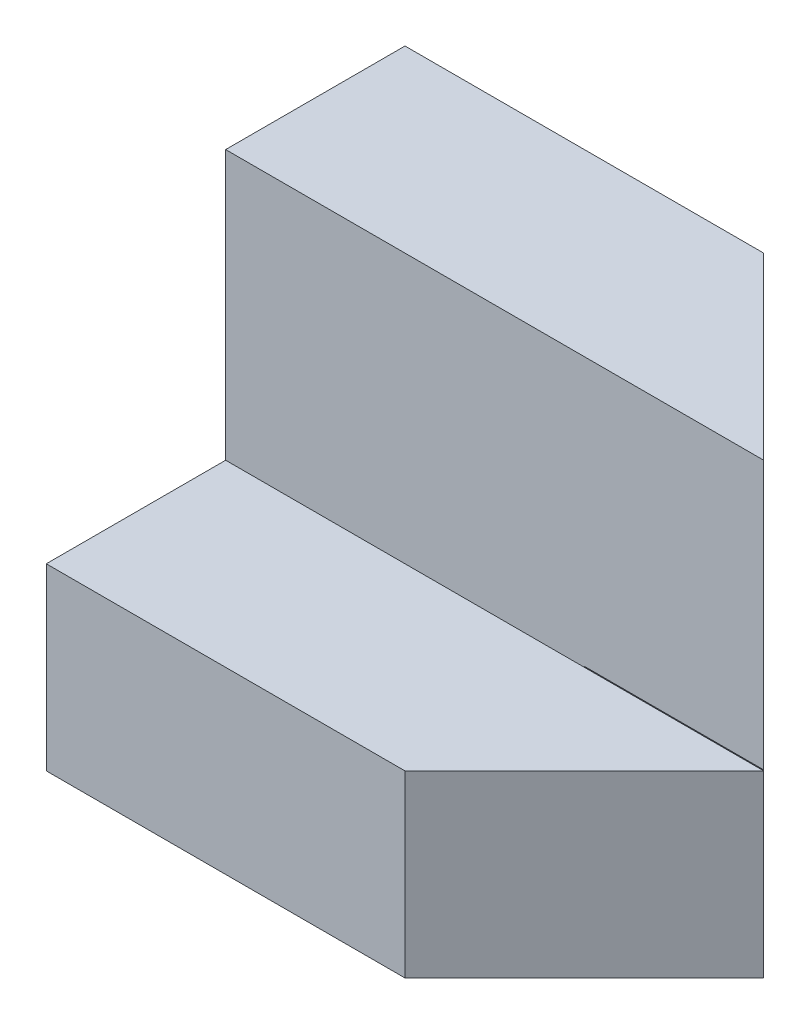
ISO-10303-21;
HEADER;
FILE_DESCRIPTION(('STEP AP214'),'2;1');
FILE_NAME('part.step','',(''),(''),'','','');
FILE_SCHEMA(('AUTOMOTIVE_DESIGN { 1 0 10303 214 1 1 1 1 }'));
ENDSEC;
DATA;
#1=APPLICATION_CONTEXT('core data for automotive mechanical design processes');
#2=APPLICATION_PROTOCOL_DEFINITION('international standard','automotive_design',2000,#1);
#3=PRODUCT_CONTEXT('',#1,'mechanical');
#4=PRODUCT('Part','Part','',(#3));
#5=PRODUCT_RELATED_PRODUCT_CATEGORY('part','',(#4));
#6=PRODUCT_DEFINITION_FORMATION('','',#4);
#7=PRODUCT_DEFINITION_CONTEXT('part definition',#1,'design');
#8=PRODUCT_DEFINITION('design','',#6,#7);
#9=PRODUCT_DEFINITION_SHAPE('','',#8);
#10=(LENGTH_UNIT() NAMED_UNIT(*) SI_UNIT(.MILLI.,.METRE.));
#11=(NAMED_UNIT(*) PLANE_ANGLE_UNIT() SI_UNIT($,.RADIAN.));
#12=(NAMED_UNIT(*) SI_UNIT($,.STERADIAN.) SOLID_ANGLE_UNIT());
#13=UNCERTAINTY_MEASURE_WITH_UNIT(LENGTH_MEASURE(1.E-05),#10,'distance_accuracy_value','');
#14=(GEOMETRIC_REPRESENTATION_CONTEXT(3) GLOBAL_UNCERTAINTY_ASSIGNED_CONTEXT((#13)) GLOBAL_UNIT_ASSIGNED_CONTEXT((#10,
#11,#12)) REPRESENTATION_CONTEXT('',''));
#15=CARTESIAN_POINT('',(0.,0.,0.));
#16=DIRECTION('',(0.,0.,1.));
#17=DIRECTION('',(1.,0.,0.));
#18=AXIS2_PLACEMENT_3D('',#15,#16,#17);
#19=CARTESIAN_POINT('',(2.,-2.5,2.));
#20=DIRECTION('',(-1.,0.,0.));
#21=DIRECTION('',(0.,0.,1.));
#22=AXIS2_PLACEMENT_3D('',#19,#20,#21);
#23=PLANE('',#22);
#24=DIRECTION('',(0.,0.,1.));
#25=VECTOR('',#24,1.);
#26=CARTESIAN_POINT('',(2.,-0.49,2.));
#27=LINE('',#26,#25);
#28=CARTESIAN_POINT('',(2.,-0.49,0.));
#29=VERTEX_POINT('',#28);
#30=CARTESIAN_POINT('',(2.,-0.49,2.));
#31=VERTEX_POINT('',#30);
#32=EDGE_CURVE('E49',#29,#31,#27,.T.);
#33=ORIENTED_EDGE('',*,*,#32,.T.);
#34=DIRECTION('',(0.,1.,0.));
#35=VECTOR('',#34,1.);
#36=CARTESIAN_POINT('',(2.,-2.5,2.));
#37=LINE('',#36,#35);
#38=CARTESIAN_POINT('',(2.,-0.5,2.));
#39=VERTEX_POINT('',#38);
#40=EDGE_CURVE('E120',#39,#31,#37,.T.);
#41=ORIENTED_EDGE('',*,*,#40,.F.);
#42=DIRECTION('',(0.,1.,0.));
#43=VECTOR('',#42,1.);
#44=CARTESIAN_POINT('',(2.,-2.5,2.));
#45=LINE('',#44,#43);
#46=CARTESIAN_POINT('',(2.,-2.5,2.));
#47=VERTEX_POINT('',#46);
#48=EDGE_CURVE('E142',#47,#39,#45,.T.);
#49=ORIENTED_EDGE('',*,*,#48,.F.);
#50=DIRECTION('',(0.,0.,-1.));
#51=VECTOR('',#50,1.);
#52=CARTESIAN_POINT('',(2.,-2.5,2.));
#53=LINE('',#52,#51);
#54=CARTESIAN_POINT('',(2.,-2.5,0.));
#55=VERTEX_POINT('',#54);
#56=EDGE_CURVE('E147',#47,#55,#53,.T.);
#57=ORIENTED_EDGE('',*,*,#56,.T.);
#58=DIRECTION('',(0.,1.,0.));
#59=VECTOR('',#58,1.);
#60=CARTESIAN_POINT('',(2.,-2.5,0.));
#61=LINE('',#60,#59);
#62=EDGE_CURVE('E190',#55,#29,#61,.T.);
#63=ORIENTED_EDGE('',*,*,#62,.T.);
#64=EDGE_LOOP('',(#33,#41,#49,#57,#63));
#65=FACE_BOUND('',#64,.T.);
#66=ADVANCED_FACE('F33',(#65),#23,.F.);
#67=CARTESIAN_POINT('',(0.,0.,2.));
#68=DIRECTION('',(0.,0.,-1.));
#69=DIRECTION('',(-1.,0.,0.));
#70=AXIS2_PLACEMENT_3D('',#67,#68,#69);
#71=PLANE('',#70);
#72=DIRECTION('',(-1.,0.,0.));
#73=VECTOR('',#72,1.);
#74=CARTESIAN_POINT('',(-2.,-0.5,2.));
#75=LINE('',#74,#73);
#76=CARTESIAN_POINT('',(-2.,-0.5,2.));
#77=VERTEX_POINT('',#76);
#78=EDGE_CURVE('E146',#39,#77,#75,.T.);
#79=ORIENTED_EDGE('',*,*,#78,.F.);
#80=ORIENTED_EDGE('',*,*,#40,.T.);
#81=DIRECTION('',(1.,0.,0.));
#82=VECTOR('',#81,1.);
#83=CARTESIAN_POINT('',(4.00000000000005,-0.49,2.));
#84=LINE('',#83,#82);
#85=CARTESIAN_POINT('',(4.00000000000005,-0.49,2.));
#86=VERTEX_POINT('',#85);
#87=EDGE_CURVE('E117',#31,#86,#84,.T.);
#88=ORIENTED_EDGE('',*,*,#87,.T.);
#89=DIRECTION('',(0.,1.,0.));
#90=VECTOR('',#89,1.);
#91=CARTESIAN_POINT('',(4.00000000000005,-0.49,2.));
#92=LINE('',#91,#90);
#93=CARTESIAN_POINT('',(4.00000000000005,2.5,2.));
#94=VERTEX_POINT('',#93);
#95=EDGE_CURVE('E107',#86,#94,#92,.T.);
#96=ORIENTED_EDGE('',*,*,#95,.T.);
#97=DIRECTION('',(-1.,0.,0.));
#98=VECTOR('',#97,1.);
#99=CARTESIAN_POINT('',(-2.,2.5,2.));
#100=LINE('',#99,#98);
#101=CARTESIAN_POINT('',(-2.,2.5,2.));
#102=VERTEX_POINT('',#101);
#103=EDGE_CURVE('E178',#94,#102,#100,.T.);
#104=ORIENTED_EDGE('',*,*,#103,.T.);
#105=DIRECTION('',(0.,-1.,0.));
#106=VECTOR('',#105,1.);
#107=CARTESIAN_POINT('',(-2.,-2.5,2.));
#108=LINE('',#107,#106);
#109=EDGE_CURVE('E176',#102,#77,#108,.T.);
#110=ORIENTED_EDGE('',*,*,#109,.T.);
#111=EDGE_LOOP('',(#79,#80,#88,#96,#104,#110));
#112=FACE_BOUND('',#111,.T.);
#113=ADVANCED_FACE('F119',(#112),#71,.F.);
#114=CARTESIAN_POINT('',(-2.,2.5,2.));
#115=DIRECTION('',(0.,-1.,0.));
#116=DIRECTION('',(0.,0.,-1.));
#117=AXIS2_PLACEMENT_3D('',#114,#115,#116);
#118=PLANE('',#117);
#119=DIRECTION('',(-1.,0.,0.));
#120=VECTOR('',#119,1.);
#121=CARTESIAN_POINT('',(-2.,2.5,0.));
#122=LINE('',#121,#120);
#123=CARTESIAN_POINT('',(2.,2.5,0.));
#124=VERTEX_POINT('',#123);
#125=CARTESIAN_POINT('',(-2.,2.5,0.));
#126=VERTEX_POINT('',#125);
#127=EDGE_CURVE('E192',#124,#126,#122,.T.);
#128=ORIENTED_EDGE('',*,*,#127,.T.);
#129=DIRECTION('',(0.,0.,-1.));
#130=VECTOR('',#129,1.);
#131=CARTESIAN_POINT('',(-2.,2.5,2.));
#132=LINE('',#131,#130);
#133=EDGE_CURVE('E11',#102,#126,#132,.T.);
#134=ORIENTED_EDGE('',*,*,#133,.F.);
#135=ORIENTED_EDGE('',*,*,#103,.F.);
#136=DIRECTION('',(-0.707106781186556,0.,-0.707106781186539));
#137=VECTOR('',#136,1.);
#138=CARTESIAN_POINT('',(2.,2.5,0.));
#139=LINE('',#138,#137);
#140=EDGE_CURVE('E113',#94,#124,#139,.T.);
#141=ORIENTED_EDGE('',*,*,#140,.T.);
#142=EDGE_LOOP('',(#128,#134,#135,#141));
#143=FACE_BOUND('',#142,.T.);
#144=ADVANCED_FACE('F225',(#143),#118,.F.);
#145=CARTESIAN_POINT('',(-2.,-2.5,2.));
#146=DIRECTION('',(1.,0.,0.));
#147=DIRECTION('',(0.,0.,-1.));
#148=AXIS2_PLACEMENT_3D('',#145,#146,#147);
#149=PLANE('',#148);
#150=DIRECTION('',(0.,-1.,0.));
#151=VECTOR('',#150,1.);
#152=CARTESIAN_POINT('',(-2.,-2.5,0.));
#153=LINE('',#152,#151);
#154=CARTESIAN_POINT('',(-2.,-2.5,0.));
#155=VERTEX_POINT('',#154);
#156=EDGE_CURVE('E195',#126,#155,#153,.T.);
#157=ORIENTED_EDGE('',*,*,#156,.T.);
#158=DIRECTION('',(0.,0.,-1.));
#159=VECTOR('',#158,1.);
#160=CARTESIAN_POINT('',(-2.,-2.5,2.));
#161=LINE('',#160,#159);
#162=CARTESIAN_POINT('',(-2.,-2.5,4.));
#163=VERTEX_POINT('',#162);
#164=EDGE_CURVE('E41',#163,#155,#161,.T.);
#165=ORIENTED_EDGE('',*,*,#164,.F.);
#166=DIRECTION('',(0.,-1.,0.));
#167=VECTOR('',#166,1.);
#168=CARTESIAN_POINT('',(-2.,-2.5,4.));
#169=LINE('',#168,#167);
#170=CARTESIAN_POINT('',(-2.,-0.5,4.));
#171=VERTEX_POINT('',#170);
#172=EDGE_CURVE('E326',#171,#163,#169,.T.);
#173=ORIENTED_EDGE('',*,*,#172,.F.);
#174=DIRECTION('',(0.,0.,-1.));
#175=VECTOR('',#174,1.);
#176=CARTESIAN_POINT('',(-2.,-0.5,4.));
#177=LINE('',#176,#175);
#178=EDGE_CURVE('E193',#171,#77,#177,.T.);
#179=ORIENTED_EDGE('',*,*,#178,.T.);
#180=ORIENTED_EDGE('',*,*,#109,.F.);
#181=ORIENTED_EDGE('',*,*,#133,.T.);
#182=EDGE_LOOP('',(#157,#165,#173,#179,#180,#181));
#183=FACE_BOUND('',#182,.T.);
#184=ADVANCED_FACE('F200',(#183),#149,.F.);
#185=CARTESIAN_POINT('',(-2.,-2.5,2.));
#186=DIRECTION('',(0.,1.,0.));
#187=DIRECTION('',(0.,0.,1.));
#188=AXIS2_PLACEMENT_3D('',#185,#186,#187);
#189=PLANE('',#188);
#190=DIRECTION('',(1.,0.,0.));
#191=VECTOR('',#190,1.);
#192=CARTESIAN_POINT('',(-2.,-2.5,0.));
#193=LINE('',#192,#191);
#194=EDGE_CURVE('E175',#155,#55,#193,.T.);
#195=ORIENTED_EDGE('',*,*,#194,.T.);
#196=ORIENTED_EDGE('',*,*,#56,.F.);
#197=DIRECTION('',(-1.,0.,0.));
#198=VECTOR('',#197,1.);
#199=CARTESIAN_POINT('',(4.,-2.5,2.));
#200=LINE('',#199,#198);
#201=CARTESIAN_POINT('',(4.,-2.5,2.));
#202=VERTEX_POINT('',#201);
#203=EDGE_CURVE('E133',#202,#47,#200,.T.);
#204=ORIENTED_EDGE('',*,*,#203,.F.);
#205=DIRECTION('',(0.707106781186547,0.,-0.707106781186548));
#206=VECTOR('',#205,1.);
#207=CARTESIAN_POINT('',(2.,-2.5,4.));
#208=LINE('',#207,#206);
#209=CARTESIAN_POINT('',(2.,-2.5,4.));
#210=VERTEX_POINT('',#209);
#211=EDGE_CURVE('E130',#210,#202,#208,.T.);
#212=ORIENTED_EDGE('',*,*,#211,.F.);
#213=DIRECTION('',(1.,0.,0.));
#214=VECTOR('',#213,1.);
#215=CARTESIAN_POINT('',(-2.,-2.5,4.));
#216=LINE('',#215,#214);
#217=EDGE_CURVE('E204',#163,#210,#216,.T.);
#218=ORIENTED_EDGE('',*,*,#217,.F.);
#219=ORIENTED_EDGE('',*,*,#164,.T.);
#220=EDGE_LOOP('',(#195,#196,#204,#212,#218,#219));
#221=FACE_BOUND('',#220,.T.);
#222=ADVANCED_FACE('F172',(#221),#189,.F.);
#223=CARTESIAN_POINT('',(0.,0.,0.));
#224=DIRECTION('',(0.,0.,-1.));
#225=DIRECTION('',(-1.,0.,0.));
#226=AXIS2_PLACEMENT_3D('',#223,#224,#225);
#227=PLANE('',#226);
#228=ORIENTED_EDGE('',*,*,#62,.F.);
#229=ORIENTED_EDGE('',*,*,#194,.F.);
#230=ORIENTED_EDGE('',*,*,#156,.F.);
#231=ORIENTED_EDGE('',*,*,#127,.F.);
#232=DIRECTION('',(0.,1.,0.));
#233=VECTOR('',#232,1.);
#234=CARTESIAN_POINT('',(2.,-0.49,0.));
#235=LINE('',#234,#233);
#236=EDGE_CURVE('E57',#29,#124,#235,.T.);
#237=ORIENTED_EDGE('',*,*,#236,.F.);
#238=EDGE_LOOP('',(#228,#229,#230,#231,#237));
#239=FACE_BOUND('',#238,.T.);
#240=ADVANCED_FACE('F206',(#239),#227,.T.);
#241=CARTESIAN_POINT('',(-2.,-0.5,4.));
#242=DIRECTION('',(0.,-1.,0.));
#243=DIRECTION('',(0.,0.,-1.));
#244=AXIS2_PLACEMENT_3D('',#241,#242,#243);
#245=PLANE('',#244);
#246=ORIENTED_EDGE('',*,*,#78,.T.);
#247=ORIENTED_EDGE('',*,*,#178,.F.);
#248=DIRECTION('',(-1.,0.,0.));
#249=VECTOR('',#248,1.);
#250=CARTESIAN_POINT('',(-2.,-0.5,4.));
#251=LINE('',#250,#249);
#252=CARTESIAN_POINT('',(2.,-0.5,4.));
#253=VERTEX_POINT('',#252);
#254=EDGE_CURVE('E167',#253,#171,#251,.T.);
#255=ORIENTED_EDGE('',*,*,#254,.F.);
#256=DIRECTION('',(0.707106781186547,0.,-0.707106781186548));
#257=VECTOR('',#256,1.);
#258=CARTESIAN_POINT('',(2.,-0.5,4.));
#259=LINE('',#258,#257);
#260=CARTESIAN_POINT('',(4.,-0.5,2.));
#261=VERTEX_POINT('',#260);
#262=EDGE_CURVE('E128',#253,#261,#259,.T.);
#263=ORIENTED_EDGE('',*,*,#262,.T.);
#264=DIRECTION('',(-1.,0.,0.));
#265=VECTOR('',#264,1.);
#266=CARTESIAN_POINT('',(4.,-0.5,2.));
#267=LINE('',#266,#265);
#268=EDGE_CURVE('E134',#261,#39,#267,.T.);
#269=ORIENTED_EDGE('',*,*,#268,.T.);
#270=EDGE_LOOP('',(#246,#247,#255,#263,#269));
#271=FACE_BOUND('',#270,.T.);
#272=ADVANCED_FACE('F165',(#271),#245,.F.);
#273=CARTESIAN_POINT('',(0.,0.,4.));
#274=DIRECTION('',(0.,0.,-1.));
#275=DIRECTION('',(-1.,0.,0.));
#276=AXIS2_PLACEMENT_3D('',#273,#274,#275);
#277=PLANE('',#276);
#278=ORIENTED_EDGE('',*,*,#172,.T.);
#279=ORIENTED_EDGE('',*,*,#217,.T.);
#280=DIRECTION('',(0.,1.,0.));
#281=VECTOR('',#280,1.);
#282=CARTESIAN_POINT('',(2.,-2.5,4.));
#283=LINE('',#282,#281);
#284=EDGE_CURVE('E328',#210,#253,#283,.T.);
#285=ORIENTED_EDGE('',*,*,#284,.T.);
#286=ORIENTED_EDGE('',*,*,#254,.T.);
#287=EDGE_LOOP('',(#278,#279,#285,#286));
#288=FACE_BOUND('',#287,.T.);
#289=ADVANCED_FACE('F214',(#288),#277,.F.);
#290=CARTESIAN_POINT('',(4.,-2.5,2.));
#291=DIRECTION('',(0.,0.,-1.));
#292=DIRECTION('',(-1.,0.,0.));
#293=AXIS2_PLACEMENT_3D('',#290,#291,#292);
#294=PLANE('',#293);
#295=ORIENTED_EDGE('',*,*,#268,.F.);
#296=DIRECTION('',(0.,1.,0.));
#297=VECTOR('',#296,1.);
#298=CARTESIAN_POINT('',(4.,-2.5,2.));
#299=LINE('',#298,#297);
#300=EDGE_CURVE('E139',#202,#261,#299,.T.);
#301=ORIENTED_EDGE('',*,*,#300,.F.);
#302=ORIENTED_EDGE('',*,*,#203,.T.);
#303=ORIENTED_EDGE('',*,*,#48,.T.);
#304=EDGE_LOOP('',(#295,#301,#302,#303));
#305=FACE_BOUND('',#304,.T.);
#306=ADVANCED_FACE('F168',(#305),#294,.T.);
#307=CARTESIAN_POINT('',(2.,-2.5,4.));
#308=DIRECTION('',(0.707106781186548,0.,0.707106781186547));
#309=DIRECTION('',(0.707106781186547,0.,-0.707106781186548));
#310=AXIS2_PLACEMENT_3D('',#307,#308,#309);
#311=PLANE('',#310);
#312=ORIENTED_EDGE('',*,*,#262,.F.);
#313=ORIENTED_EDGE('',*,*,#284,.F.);
#314=ORIENTED_EDGE('',*,*,#211,.T.);
#315=ORIENTED_EDGE('',*,*,#300,.T.);
#316=EDGE_LOOP('',(#312,#313,#314,#315));
#317=FACE_BOUND('',#316,.T.);
#318=ADVANCED_FACE('F158',(#317),#311,.T.);
#319=CARTESIAN_POINT('',(2.,-0.49,0.));
#320=DIRECTION('',(0.707106781186539,0.,-0.707106781186556));
#321=DIRECTION('',(-0.707106781186556,0.,-0.707106781186539));
#322=AXIS2_PLACEMENT_3D('',#319,#320,#321);
#323=PLANE('',#322);
#324=ORIENTED_EDGE('',*,*,#140,.F.);
#325=ORIENTED_EDGE('',*,*,#95,.F.);
#326=DIRECTION('',(-0.707106781186556,0.,-0.707106781186539));
#327=VECTOR('',#326,1.);
#328=CARTESIAN_POINT('',(2.,-0.49,0.));
#329=LINE('',#328,#327);
#330=EDGE_CURVE('E111',#86,#29,#329,.T.);
#331=ORIENTED_EDGE('',*,*,#330,.T.);
#332=ORIENTED_EDGE('',*,*,#236,.T.);
#333=EDGE_LOOP('',(#324,#325,#331,#332));
#334=FACE_BOUND('',#333,.T.);
#335=ADVANCED_FACE('F109',(#334),#323,.T.);
#336=CARTESIAN_POINT('',(0.,-0.49,0.));
#337=DIRECTION('',(0.,1.,0.));
#338=DIRECTION('',(0.,0.,1.));
#339=AXIS2_PLACEMENT_3D('',#336,#337,#338);
#340=PLANE('',#339);
#341=ORIENTED_EDGE('',*,*,#32,.F.);
#342=ORIENTED_EDGE('',*,*,#330,.F.);
#343=ORIENTED_EDGE('',*,*,#87,.F.);
#344=EDGE_LOOP('',(#341,#342,#343));
#345=FACE_BOUND('',#344,.T.);
#346=ADVANCED_FACE('F123',(#345),#340,.F.);
#347=CLOSED_SHELL('',(#66,#113,#144,#184,#222,#240,#272,#289,#306,#318,#335,#346));
#348=MANIFOLD_SOLID_BREP('B2',#347);
#349=ADVANCED_BREP_SHAPE_REPRESENTATION('',(#18,#348),#14);
#350=SHAPE_DEFINITION_REPRESENTATION(#9,#349);
ENDSEC;
END-ISO-10303-21;
